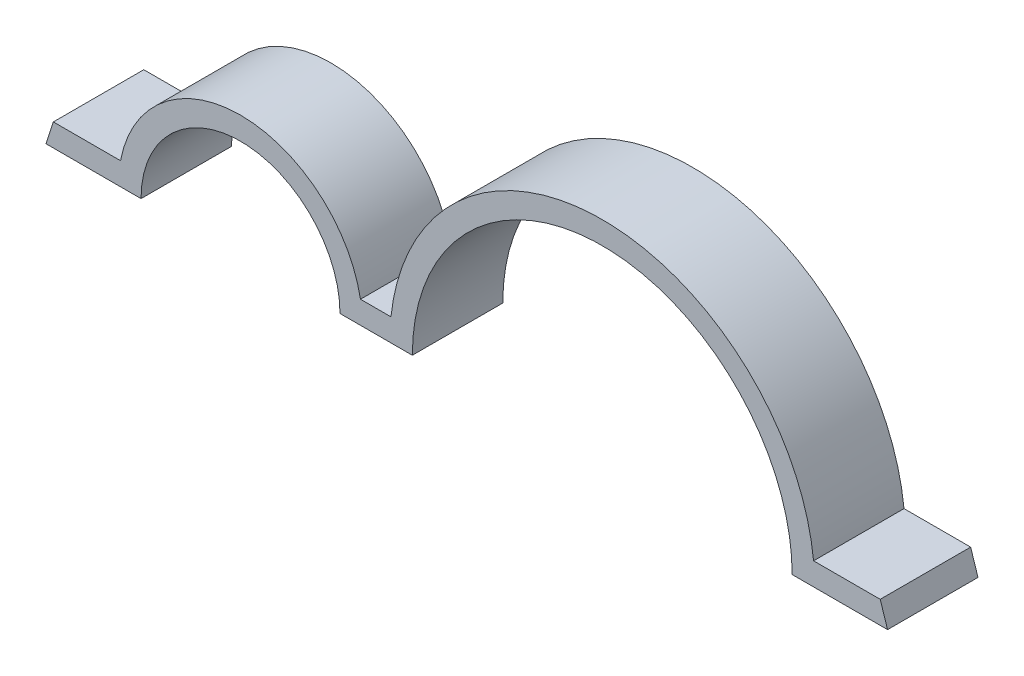
ISO-10303-21;
HEADER;
FILE_DESCRIPTION(('STEP AP214'),'2;1');
FILE_NAME('part.step','',(''),(''),'','','');
FILE_SCHEMA(('AUTOMOTIVE_DESIGN { 1 0 10303 214 1 1 1 1 }'));
ENDSEC;
DATA;
#1=APPLICATION_CONTEXT('core data for automotive mechanical design processes');
#2=APPLICATION_PROTOCOL_DEFINITION('international standard','automotive_design',2000,#1);
#3=PRODUCT_CONTEXT('',#1,'mechanical');
#4=PRODUCT('Part','Part','',(#3));
#5=PRODUCT_RELATED_PRODUCT_CATEGORY('part','',(#4));
#6=PRODUCT_DEFINITION_FORMATION('','',#4);
#7=PRODUCT_DEFINITION_CONTEXT('part definition',#1,'design');
#8=PRODUCT_DEFINITION('design','',#6,#7);
#9=PRODUCT_DEFINITION_SHAPE('','',#8);
#10=(LENGTH_UNIT() NAMED_UNIT(*) SI_UNIT(.MILLI.,.METRE.));
#11=(NAMED_UNIT(*) PLANE_ANGLE_UNIT() SI_UNIT($,.RADIAN.));
#12=(NAMED_UNIT(*) SI_UNIT($,.STERADIAN.) SOLID_ANGLE_UNIT());
#13=UNCERTAINTY_MEASURE_WITH_UNIT(LENGTH_MEASURE(1.E-05),#10,'distance_accuracy_value','');
#14=(GEOMETRIC_REPRESENTATION_CONTEXT(3) GLOBAL_UNCERTAINTY_ASSIGNED_CONTEXT((#13)) GLOBAL_UNIT_ASSIGNED_CONTEXT((#10,
#11,#12)) REPRESENTATION_CONTEXT('',''));
#15=CARTESIAN_POINT('',(0.,0.,0.));
#16=DIRECTION('',(0.,0.,1.));
#17=DIRECTION('',(1.,0.,0.));
#18=AXIS2_PLACEMENT_3D('',#15,#16,#17);
#19=CARTESIAN_POINT('',(-15.8877,172.775844824906,6.35));
#20=DIRECTION('',(0.,0.,-1.));
#21=DIRECTION('',(-1.,0.,0.));
#22=AXIS2_PLACEMENT_3D('',#19,#20,#21);
#23=CYLINDRICAL_SURFACE('',#22,6.985);
#24=CARTESIAN_POINT('',(-15.8877,172.775844824906,0.));
#25=DIRECTION('',(0.,0.,-1.));
#26=DIRECTION('',(1.,0.,0.));
#27=AXIS2_PLACEMENT_3D('',#24,#25,#26);
#28=CIRCLE('',#27,6.985);
#29=CARTESIAN_POINT('',(-22.8727,172.775844824906,0.));
#30=VERTEX_POINT('',#29);
#31=CARTESIAN_POINT('',(-8.90269999999999,172.775844824906,0.));
#32=VERTEX_POINT('',#31);
#33=EDGE_CURVE('E164',#30,#32,#28,.T.);
#34=ORIENTED_EDGE('',*,*,#33,.T.);
#35=DIRECTION('',(0.,0.,-1.));
#36=VECTOR('',#35,1.);
#37=CARTESIAN_POINT('',(-8.90269999999999,172.775844824906,6.35));
#38=LINE('',#37,#36);
#39=CARTESIAN_POINT('',(-8.90269999999999,172.775844824906,6.35));
#40=VERTEX_POINT('',#39);
#41=EDGE_CURVE('E11',#40,#32,#38,.T.);
#42=ORIENTED_EDGE('',*,*,#41,.F.);
#43=CARTESIAN_POINT('',(-15.8877,172.775844824906,6.35));
#44=DIRECTION('',(0.,0.,-1.));
#45=DIRECTION('',(1.,0.,0.));
#46=AXIS2_PLACEMENT_3D('',#43,#44,#45);
#47=CIRCLE('',#46,6.985);
#48=CARTESIAN_POINT('',(-22.8727,172.775844824906,6.35));
#49=VERTEX_POINT('',#48);
#50=EDGE_CURVE('E198',#49,#40,#47,.T.);
#51=ORIENTED_EDGE('',*,*,#50,.F.);
#52=DIRECTION('',(0.,0.,-1.));
#53=VECTOR('',#52,1.);
#54=CARTESIAN_POINT('',(-22.8727,172.775844824906,6.35));
#55=LINE('',#54,#53);
#56=EDGE_CURVE('E160',#49,#30,#55,.T.);
#57=ORIENTED_EDGE('',*,*,#56,.T.);
#58=EDGE_LOOP('',(#34,#42,#51,#57));
#59=FACE_BOUND('',#58,.T.);
#60=ADVANCED_FACE('F39',(#59),#23,.F.);
#61=CARTESIAN_POINT('',(-8.90269999999999,172.775844824906,6.35));
#62=DIRECTION('',(0.,1.,0.));
#63=DIRECTION('',(0.,0.,1.));
#64=AXIS2_PLACEMENT_3D('',#61,#62,#63);
#65=PLANE('',#64);
#66=DIRECTION('',(1.,0.,0.));
#67=VECTOR('',#66,1.);
#68=CARTESIAN_POINT('',(-8.90269999999999,172.775844824906,0.));
#69=LINE('',#68,#67);
#70=CARTESIAN_POINT('',(-3.82270000000001,172.775844824906,0.));
#71=VERTEX_POINT('',#70);
#72=EDGE_CURVE('E168',#32,#71,#69,.T.);
#73=ORIENTED_EDGE('',*,*,#72,.T.);
#74=DIRECTION('',(0.,0.,-1.));
#75=VECTOR('',#74,1.);
#76=CARTESIAN_POINT('',(-3.82270000000001,172.775844824906,6.35));
#77=LINE('',#76,#75);
#78=CARTESIAN_POINT('',(-3.82270000000001,172.775844824906,6.35));
#79=VERTEX_POINT('',#78);
#80=EDGE_CURVE('E48',#79,#71,#77,.T.);
#81=ORIENTED_EDGE('',*,*,#80,.F.);
#82=DIRECTION('',(1.,0.,0.));
#83=VECTOR('',#82,1.);
#84=CARTESIAN_POINT('',(-8.90269999999999,172.775844824906,6.35));
#85=LINE('',#84,#83);
#86=EDGE_CURVE('E111',#40,#79,#85,.T.);
#87=ORIENTED_EDGE('',*,*,#86,.F.);
#88=ORIENTED_EDGE('',*,*,#41,.T.);
#89=EDGE_LOOP('',(#73,#81,#87,#88));
#90=FACE_BOUND('',#89,.T.);
#91=ADVANCED_FACE('F292',(#90),#65,.F.);
#92=CARTESIAN_POINT('',(9.5123,172.775844824906,6.35));
#93=DIRECTION('',(0.,0.,-1.));
#94=DIRECTION('',(-1.,0.,0.));
#95=AXIS2_PLACEMENT_3D('',#92,#93,#94);
#96=CYLINDRICAL_SURFACE('',#95,13.335);
#97=CARTESIAN_POINT('',(9.5123,172.775844824906,0.));
#98=DIRECTION('',(0.,0.,-1.));
#99=DIRECTION('',(1.,0.,0.));
#100=AXIS2_PLACEMENT_3D('',#97,#98,#99);
#101=CIRCLE('',#100,13.335);
#102=CARTESIAN_POINT('',(22.8473,172.775844824906,0.));
#103=VERTEX_POINT('',#102);
#104=EDGE_CURVE('E171',#71,#103,#101,.T.);
#105=ORIENTED_EDGE('',*,*,#104,.T.);
#106=DIRECTION('',(0.,0.,-1.));
#107=VECTOR('',#106,1.);
#108=CARTESIAN_POINT('',(22.8473,172.775844824906,6.35));
#109=LINE('',#108,#107);
#110=CARTESIAN_POINT('',(22.8473,172.775844824906,6.35));
#111=VERTEX_POINT('',#110);
#112=EDGE_CURVE('E225',#111,#103,#109,.T.);
#113=ORIENTED_EDGE('',*,*,#112,.F.);
#114=CARTESIAN_POINT('',(9.5123,172.775844824906,6.35));
#115=DIRECTION('',(0.,0.,-1.));
#116=DIRECTION('',(1.,0.,0.));
#117=AXIS2_PLACEMENT_3D('',#114,#115,#116);
#118=CIRCLE('',#117,13.335);
#119=EDGE_CURVE('E235',#79,#111,#118,.T.);
#120=ORIENTED_EDGE('',*,*,#119,.F.);
#121=ORIENTED_EDGE('',*,*,#80,.T.);
#122=EDGE_LOOP('',(#105,#113,#120,#121));
#123=FACE_BOUND('',#122,.T.);
#124=ADVANCED_FACE('F233',(#123),#96,.F.);
#125=CARTESIAN_POINT('',(22.8473,172.775844824906,6.35));
#126=DIRECTION('',(0.,1.,0.));
#127=DIRECTION('',(0.,0.,1.));
#128=AXIS2_PLACEMENT_3D('',#125,#126,#127);
#129=PLANE('',#128);
#130=DIRECTION('',(1.,0.,0.));
#131=VECTOR('',#130,1.);
#132=CARTESIAN_POINT('',(22.8473,172.775844824906,0.));
#133=LINE('',#132,#131);
#134=CARTESIAN_POINT('',(29.5452417978428,172.775844824906,0.));
#135=VERTEX_POINT('',#134);
#136=EDGE_CURVE('E174',#103,#135,#133,.T.);
#137=ORIENTED_EDGE('',*,*,#136,.T.);
#138=DIRECTION('',(0.,0.,-1.));
#139=VECTOR('',#138,1.);
#140=CARTESIAN_POINT('',(29.5452417978428,172.775844824906,6.35));
#141=LINE('',#140,#139);
#142=CARTESIAN_POINT('',(29.5452417978428,172.775844824906,6.35));
#143=VERTEX_POINT('',#142);
#144=EDGE_CURVE('E221',#143,#135,#141,.T.);
#145=ORIENTED_EDGE('',*,*,#144,.F.);
#146=DIRECTION('',(1.,0.,0.));
#147=VECTOR('',#146,1.);
#148=CARTESIAN_POINT('',(22.8473,172.775844824906,6.35));
#149=LINE('',#148,#147);
#150=EDGE_CURVE('E254',#111,#143,#149,.T.);
#151=ORIENTED_EDGE('',*,*,#150,.F.);
#152=ORIENTED_EDGE('',*,*,#112,.T.);
#153=EDGE_LOOP('',(#137,#145,#151,#152));
#154=FACE_BOUND('',#153,.T.);
#155=ADVANCED_FACE('F244',(#154),#129,.F.);
#156=CARTESIAN_POINT('',(29.0287347184856,174.363344824906,6.35));
#157=DIRECTION('',(-0.950933726670707,-0.309394646818849,0.));
#158=DIRECTION('',(0.309394646818849,-0.950933726670708,0.));
#159=AXIS2_PLACEMENT_3D('',#156,#157,#158);
#160=PLANE('',#159);
#161=DIRECTION('',(-0.309394646818849,0.950933726670708,0.));
#162=VECTOR('',#161,1.);
#163=CARTESIAN_POINT('',(29.0287347184856,174.363344824906,0.));
#164=LINE('',#163,#162);
#165=CARTESIAN_POINT('',(29.0287347184856,174.363344824906,0.));
#166=VERTEX_POINT('',#165);
#167=EDGE_CURVE('E177',#135,#166,#164,.T.);
#168=ORIENTED_EDGE('',*,*,#167,.T.);
#169=DIRECTION('',(0.,0.,-1.));
#170=VECTOR('',#169,1.);
#171=CARTESIAN_POINT('',(29.0287347184856,174.363344824906,6.35));
#172=LINE('',#171,#170);
#173=CARTESIAN_POINT('',(29.0287347184856,174.363344824906,6.35));
#174=VERTEX_POINT('',#173);
#175=EDGE_CURVE('E217',#174,#166,#172,.T.);
#176=ORIENTED_EDGE('',*,*,#175,.F.);
#177=DIRECTION('',(-0.309394646818849,0.950933726670708,0.));
#178=VECTOR('',#177,1.);
#179=CARTESIAN_POINT('',(29.0287347184856,174.363344824906,6.35));
#180=LINE('',#179,#178);
#181=EDGE_CURVE('E250',#143,#174,#180,.T.);
#182=ORIENTED_EDGE('',*,*,#181,.F.);
#183=ORIENTED_EDGE('',*,*,#144,.T.);
#184=EDGE_LOOP('',(#168,#176,#182,#183));
#185=FACE_BOUND('',#184,.T.);
#186=ADVANCED_FACE('F248',(#185),#160,.F.);
#187=CARTESIAN_POINT('',(24.3501182358459,174.363344824906,6.35));
#188=DIRECTION('',(0.,-1.,0.));
#189=DIRECTION('',(1.,0.,0.));
#190=AXIS2_PLACEMENT_3D('',#187,#188,#189);
#191=PLANE('',#190);
#192=DIRECTION('',(-1.,0.,0.));
#193=VECTOR('',#192,1.);
#194=CARTESIAN_POINT('',(24.3501182358459,174.363344824906,0.));
#195=LINE('',#194,#193);
#196=CARTESIAN_POINT('',(24.3501182358459,174.363344824906,0.));
#197=VERTEX_POINT('',#196);
#198=EDGE_CURVE('E180',#166,#197,#195,.T.);
#199=ORIENTED_EDGE('',*,*,#198,.T.);
#200=DIRECTION('',(0.,0.,-1.));
#201=VECTOR('',#200,1.);
#202=CARTESIAN_POINT('',(24.3501182358459,174.363344824906,6.35));
#203=LINE('',#202,#201);
#204=CARTESIAN_POINT('',(24.3501182358459,174.363344824906,6.35));
#205=VERTEX_POINT('',#204);
#206=EDGE_CURVE('E213',#205,#197,#203,.T.);
#207=ORIENTED_EDGE('',*,*,#206,.F.);
#208=DIRECTION('',(-1.,0.,0.));
#209=VECTOR('',#208,1.);
#210=CARTESIAN_POINT('',(24.3501182358459,174.363344824906,6.35));
#211=LINE('',#210,#209);
#212=EDGE_CURVE('E253',#174,#205,#211,.T.);
#213=ORIENTED_EDGE('',*,*,#212,.F.);
#214=ORIENTED_EDGE('',*,*,#175,.T.);
#215=EDGE_LOOP('',(#199,#207,#213,#214));
#216=FACE_BOUND('',#215,.T.);
#217=ADVANCED_FACE('F305',(#216),#191,.F.);
#218=CARTESIAN_POINT('',(9.5123,172.775844824906,6.35));
#219=DIRECTION('',(0.,0.,-1.));
#220=DIRECTION('',(-1.,0.,0.));
#221=AXIS2_PLACEMENT_3D('',#218,#219,#220);
#222=CYLINDRICAL_SURFACE('',#221,14.9225);
#223=CARTESIAN_POINT('',(9.5123,172.775844824906,0.));
#224=DIRECTION('',(0.,0.,1.));
#225=DIRECTION('',(1.,0.,0.));
#226=AXIS2_PLACEMENT_3D('',#223,#224,#225);
#227=CIRCLE('',#226,14.9225);
#228=CARTESIAN_POINT('',(-5.32551823584586,174.363344824906,0.));
#229=VERTEX_POINT('',#228);
#230=EDGE_CURVE('E183',#197,#229,#227,.T.);
#231=ORIENTED_EDGE('',*,*,#230,.T.);
#232=DIRECTION('',(0.,0.,-1.));
#233=VECTOR('',#232,1.);
#234=CARTESIAN_POINT('',(-5.32551823584586,174.363344824906,6.35));
#235=LINE('',#234,#233);
#236=CARTESIAN_POINT('',(-5.32551823584586,174.363344824906,6.35));
#237=VERTEX_POINT('',#236);
#238=EDGE_CURVE('E209',#237,#229,#235,.T.);
#239=ORIENTED_EDGE('',*,*,#238,.F.);
#240=CARTESIAN_POINT('',(9.5123,172.775844824906,6.35));
#241=DIRECTION('',(0.,0.,1.));
#242=DIRECTION('',(1.,0.,0.));
#243=AXIS2_PLACEMENT_3D('',#240,#241,#242);
#244=CIRCLE('',#243,14.9225);
#245=EDGE_CURVE('E258',#205,#237,#244,.T.);
#246=ORIENTED_EDGE('',*,*,#245,.F.);
#247=ORIENTED_EDGE('',*,*,#206,.T.);
#248=EDGE_LOOP('',(#231,#239,#246,#247));
#249=FACE_BOUND('',#248,.T.);
#250=ADVANCED_FACE('F308',(#249),#222,.T.);
#251=CARTESIAN_POINT('',(-7.46347303249727,174.363344824906,6.35));
#252=DIRECTION('',(0.,-1.,0.));
#253=DIRECTION('',(0.,0.,-1.));
#254=AXIS2_PLACEMENT_3D('',#251,#252,#253);
#255=PLANE('',#254);
#256=DIRECTION('',(-1.,0.,0.));
#257=VECTOR('',#256,1.);
#258=CARTESIAN_POINT('',(-7.46347303249727,174.363344824906,0.));
#259=LINE('',#258,#257);
#260=CARTESIAN_POINT('',(-7.46347303249727,174.363344824906,0.));
#261=VERTEX_POINT('',#260);
#262=EDGE_CURVE('E186',#229,#261,#259,.T.);
#263=ORIENTED_EDGE('',*,*,#262,.T.);
#264=DIRECTION('',(0.,0.,-1.));
#265=VECTOR('',#264,1.);
#266=CARTESIAN_POINT('',(-7.46347303249727,174.363344824906,6.35));
#267=LINE('',#266,#265);
#268=CARTESIAN_POINT('',(-7.46347303249727,174.363344824906,6.35));
#269=VERTEX_POINT('',#268);
#270=EDGE_CURVE('E205',#269,#261,#267,.T.);
#271=ORIENTED_EDGE('',*,*,#270,.F.);
#272=DIRECTION('',(-1.,0.,0.));
#273=VECTOR('',#272,1.);
#274=CARTESIAN_POINT('',(-7.46347303249727,174.363344824906,6.35));
#275=LINE('',#274,#273);
#276=EDGE_CURVE('E265',#237,#269,#275,.T.);
#277=ORIENTED_EDGE('',*,*,#276,.F.);
#278=ORIENTED_EDGE('',*,*,#238,.T.);
#279=EDGE_LOOP('',(#263,#271,#277,#278));
#280=FACE_BOUND('',#279,.T.);
#281=ADVANCED_FACE('F273',(#280),#255,.F.);
#282=CARTESIAN_POINT('',(-15.8877,172.775844824906,6.35));
#283=DIRECTION('',(0.,0.,-1.));
#284=DIRECTION('',(-1.,0.,0.));
#285=AXIS2_PLACEMENT_3D('',#282,#283,#284);
#286=CYLINDRICAL_SURFACE('',#285,8.57250000000001);
#287=CARTESIAN_POINT('',(-15.8877,172.775844824906,0.));
#288=DIRECTION('',(0.,0.,1.));
#289=DIRECTION('',(1.,0.,0.));
#290=AXIS2_PLACEMENT_3D('',#287,#288,#289);
#291=CIRCLE('',#290,8.57250000000001);
#292=CARTESIAN_POINT('',(-24.3119269675027,174.363344824906,0.));
#293=VERTEX_POINT('',#292);
#294=EDGE_CURVE('E189',#261,#293,#291,.T.);
#295=ORIENTED_EDGE('',*,*,#294,.T.);
#296=DIRECTION('',(0.,0.,-1.));
#297=VECTOR('',#296,1.);
#298=CARTESIAN_POINT('',(-24.3119269675027,174.363344824906,6.35));
#299=LINE('',#298,#297);
#300=CARTESIAN_POINT('',(-24.3119269675027,174.363344824906,6.35));
#301=VERTEX_POINT('',#300);
#302=EDGE_CURVE('E153',#301,#293,#299,.T.);
#303=ORIENTED_EDGE('',*,*,#302,.F.);
#304=CARTESIAN_POINT('',(-15.8877,172.775844824906,6.35));
#305=DIRECTION('',(0.,0.,1.));
#306=DIRECTION('',(1.,0.,0.));
#307=AXIS2_PLACEMENT_3D('',#304,#305,#306);
#308=CIRCLE('',#307,8.57250000000001);
#309=EDGE_CURVE('E142',#269,#301,#308,.T.);
#310=ORIENTED_EDGE('',*,*,#309,.F.);
#311=ORIENTED_EDGE('',*,*,#270,.T.);
#312=EDGE_LOOP('',(#295,#303,#310,#311));
#313=FACE_BOUND('',#312,.T.);
#314=ADVANCED_FACE('F277',(#313),#286,.T.);
#315=CARTESIAN_POINT('',(-29.0287347184856,174.363344824906,6.35));
#316=DIRECTION('',(0.,-1.,0.));
#317=DIRECTION('',(1.,0.,0.));
#318=AXIS2_PLACEMENT_3D('',#315,#316,#317);
#319=PLANE('',#318);
#320=DIRECTION('',(-1.,0.,0.));
#321=VECTOR('',#320,1.);
#322=CARTESIAN_POINT('',(-29.0287347184856,174.363344824906,0.));
#323=LINE('',#322,#321);
#324=CARTESIAN_POINT('',(-29.0287347184856,174.363344824906,0.));
#325=VERTEX_POINT('',#324);
#326=EDGE_CURVE('E151',#293,#325,#323,.T.);
#327=ORIENTED_EDGE('',*,*,#326,.T.);
#328=DIRECTION('',(0.,0.,-1.));
#329=VECTOR('',#328,1.);
#330=CARTESIAN_POINT('',(-29.0287347184856,174.363344824906,6.35));
#331=LINE('',#330,#329);
#332=CARTESIAN_POINT('',(-29.0287347184856,174.363344824906,6.35));
#333=VERTEX_POINT('',#332);
#334=EDGE_CURVE('E148',#333,#325,#331,.T.);
#335=ORIENTED_EDGE('',*,*,#334,.F.);
#336=DIRECTION('',(-1.,0.,0.));
#337=VECTOR('',#336,1.);
#338=CARTESIAN_POINT('',(-29.0287347184856,174.363344824906,6.35));
#339=LINE('',#338,#337);
#340=EDGE_CURVE('E136',#301,#333,#339,.T.);
#341=ORIENTED_EDGE('',*,*,#340,.F.);
#342=ORIENTED_EDGE('',*,*,#302,.T.);
#343=EDGE_LOOP('',(#327,#335,#341,#342));
#344=FACE_BOUND('',#343,.T.);
#345=ADVANCED_FACE('F149',(#344),#319,.F.);
#346=CARTESIAN_POINT('',(-29.5452417978428,172.775844824906,6.35));
#347=DIRECTION('',(0.950933726670707,-0.309394646818849,0.));
#348=DIRECTION('',(0.309394646818849,0.950933726670708,0.));
#349=AXIS2_PLACEMENT_3D('',#346,#347,#348);
#350=PLANE('',#349);
#351=DIRECTION('',(-0.309394646818849,-0.950933726670708,0.));
#352=VECTOR('',#351,1.);
#353=CARTESIAN_POINT('',(-29.5452417978428,172.775844824906,0.));
#354=LINE('',#353,#352);
#355=CARTESIAN_POINT('',(-29.5452417978428,172.775844824906,0.));
#356=VERTEX_POINT('',#355);
#357=EDGE_CURVE('E97',#325,#356,#354,.T.);
#358=ORIENTED_EDGE('',*,*,#357,.T.);
#359=DIRECTION('',(0.,0.,-1.));
#360=VECTOR('',#359,1.);
#361=CARTESIAN_POINT('',(-29.5452417978428,172.775844824906,6.35));
#362=LINE('',#361,#360);
#363=CARTESIAN_POINT('',(-29.5452417978428,172.775844824906,6.35));
#364=VERTEX_POINT('',#363);
#365=EDGE_CURVE('E154',#364,#356,#362,.T.);
#366=ORIENTED_EDGE('',*,*,#365,.F.);
#367=DIRECTION('',(-0.309394646818849,-0.950933726670708,0.));
#368=VECTOR('',#367,1.);
#369=CARTESIAN_POINT('',(-29.5452417978428,172.775844824906,6.35));
#370=LINE('',#369,#368);
#371=EDGE_CURVE('E140',#333,#364,#370,.T.);
#372=ORIENTED_EDGE('',*,*,#371,.F.);
#373=ORIENTED_EDGE('',*,*,#334,.T.);
#374=EDGE_LOOP('',(#358,#366,#372,#373));
#375=FACE_BOUND('',#374,.T.);
#376=ADVANCED_FACE('F156',(#375),#350,.F.);
#377=CARTESIAN_POINT('',(-29.5452417978428,172.775844824906,6.35));
#378=DIRECTION('',(0.,1.,0.));
#379=DIRECTION('',(0.,0.,1.));
#380=AXIS2_PLACEMENT_3D('',#377,#378,#379);
#381=PLANE('',#380);
#382=DIRECTION('',(1.,0.,0.));
#383=VECTOR('',#382,1.);
#384=CARTESIAN_POINT('',(-29.5452417978428,172.775844824906,0.));
#385=LINE('',#384,#383);
#386=EDGE_CURVE('E103',#356,#30,#385,.T.);
#387=ORIENTED_EDGE('',*,*,#386,.T.);
#388=ORIENTED_EDGE('',*,*,#56,.F.);
#389=DIRECTION('',(1.,0.,0.));
#390=VECTOR('',#389,1.);
#391=CARTESIAN_POINT('',(-29.5452417978428,172.775844824906,6.35));
#392=LINE('',#391,#390);
#393=EDGE_CURVE('E56',#364,#49,#392,.T.);
#394=ORIENTED_EDGE('',*,*,#393,.F.);
#395=ORIENTED_EDGE('',*,*,#365,.T.);
#396=EDGE_LOOP('',(#387,#388,#394,#395));
#397=FACE_BOUND('',#396,.T.);
#398=ADVANCED_FACE('F281',(#397),#381,.F.);
#399=CARTESIAN_POINT('',(-15.8877,172.775844824906,6.35));
#400=DIRECTION('',(0.,0.,1.));
#401=DIRECTION('',(1.,0.,0.));
#402=AXIS2_PLACEMENT_3D('',#399,#400,#401);
#403=PLANE('',#402);
#404=ORIENTED_EDGE('',*,*,#50,.T.);
#405=ORIENTED_EDGE('',*,*,#86,.T.);
#406=ORIENTED_EDGE('',*,*,#119,.T.);
#407=ORIENTED_EDGE('',*,*,#150,.T.);
#408=ORIENTED_EDGE('',*,*,#181,.T.);
#409=ORIENTED_EDGE('',*,*,#212,.T.);
#410=ORIENTED_EDGE('',*,*,#245,.T.);
#411=ORIENTED_EDGE('',*,*,#276,.T.);
#412=ORIENTED_EDGE('',*,*,#309,.T.);
#413=ORIENTED_EDGE('',*,*,#340,.T.);
#414=ORIENTED_EDGE('',*,*,#371,.T.);
#415=ORIENTED_EDGE('',*,*,#393,.T.);
#416=EDGE_LOOP('',(#404,#405,#406,#407,#408,#409,#410,#411,#412,#413,#414,#415));
#417=FACE_BOUND('',#416,.T.);
#418=ADVANCED_FACE('F138',(#417),#403,.T.);
#419=CARTESIAN_POINT('',(-15.8877,172.775844824906,0.));
#420=DIRECTION('',(0.,0.,1.));
#421=DIRECTION('',(1.,0.,0.));
#422=AXIS2_PLACEMENT_3D('',#419,#420,#421);
#423=PLANE('',#422);
#424=ORIENTED_EDGE('',*,*,#33,.F.);
#425=ORIENTED_EDGE('',*,*,#386,.F.);
#426=ORIENTED_EDGE('',*,*,#357,.F.);
#427=ORIENTED_EDGE('',*,*,#326,.F.);
#428=ORIENTED_EDGE('',*,*,#294,.F.);
#429=ORIENTED_EDGE('',*,*,#262,.F.);
#430=ORIENTED_EDGE('',*,*,#230,.F.);
#431=ORIENTED_EDGE('',*,*,#198,.F.);
#432=ORIENTED_EDGE('',*,*,#167,.F.);
#433=ORIENTED_EDGE('',*,*,#136,.F.);
#434=ORIENTED_EDGE('',*,*,#104,.F.);
#435=ORIENTED_EDGE('',*,*,#72,.F.);
#436=EDGE_LOOP('',(#424,#425,#426,#427,#428,#429,#430,#431,#432,#433,#434,#435));
#437=FACE_BOUND('',#436,.T.);
#438=ADVANCED_FACE('F239',(#437),#423,.F.);
#439=CLOSED_SHELL('',(#60,#91,#124,#155,#186,#217,#250,#281,#314,#345,#376,#398,#418,#438));
#440=MANIFOLD_SOLID_BREP('B2',#439);
#441=ADVANCED_BREP_SHAPE_REPRESENTATION('',(#18,#440),#14);
#442=SHAPE_DEFINITION_REPRESENTATION(#9,#441);
ENDSEC;
END-ISO-10303-21;
